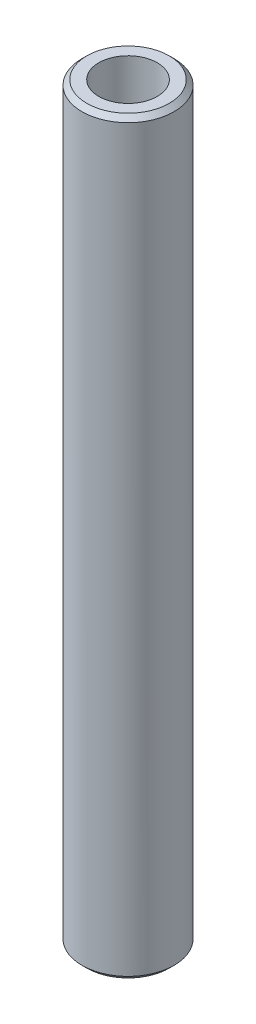
ISO-10303-21;
HEADER;
FILE_DESCRIPTION(('STEP AP214'),'2;1');
FILE_NAME('part.step','',(''),(''),'','','');
FILE_SCHEMA(('AUTOMOTIVE_DESIGN { 1 0 10303 214 1 1 1 1 }'));
ENDSEC;
DATA;
#1=APPLICATION_CONTEXT('core data for automotive mechanical design processes');
#2=APPLICATION_PROTOCOL_DEFINITION('international standard','automotive_design',2000,#1);
#3=PRODUCT_CONTEXT('',#1,'mechanical');
#4=PRODUCT('Part','Part','',(#3));
#5=PRODUCT_RELATED_PRODUCT_CATEGORY('part','',(#4));
#6=PRODUCT_DEFINITION_FORMATION('','',#4);
#7=PRODUCT_DEFINITION_CONTEXT('part definition',#1,'design');
#8=PRODUCT_DEFINITION('design','',#6,#7);
#9=PRODUCT_DEFINITION_SHAPE('','',#8);
#10=(LENGTH_UNIT() NAMED_UNIT(*) SI_UNIT(.MILLI.,.METRE.));
#11=(NAMED_UNIT(*) PLANE_ANGLE_UNIT() SI_UNIT($,.RADIAN.));
#12=(NAMED_UNIT(*) SI_UNIT($,.STERADIAN.) SOLID_ANGLE_UNIT());
#13=UNCERTAINTY_MEASURE_WITH_UNIT(LENGTH_MEASURE(1.E-05),#10,'distance_accuracy_value','');
#14=(GEOMETRIC_REPRESENTATION_CONTEXT(3) GLOBAL_UNCERTAINTY_ASSIGNED_CONTEXT((#13)) GLOBAL_UNIT_ASSIGNED_CONTEXT((#10,
#11,#12)) REPRESENTATION_CONTEXT('',''));
#15=CARTESIAN_POINT('',(0.,0.,0.));
#16=DIRECTION('',(0.,0.,1.));
#17=DIRECTION('',(1.,0.,0.));
#18=AXIS2_PLACEMENT_3D('',#15,#16,#17);
#19=CARTESIAN_POINT('',(0.,406.783600366524,0.));
#20=DIRECTION('',(0.,-1.,0.));
#21=DIRECTION('',(0.,0.,-1.));
#22=AXIS2_PLACEMENT_3D('',#19,#20,#21);
#23=CYLINDRICAL_SURFACE('',#22,25.);
#24=CARTESIAN_POINT('',(0.,404.167397021278,0.));
#25=DIRECTION('',(0.,1.,0.));
#26=DIRECTION('',(0.,0.,1.));
#27=AXIS2_PLACEMENT_3D('',#24,#25,#26);
#28=CIRCLE('',#27,25.);
#29=CARTESIAN_POINT('',(0.,404.167397021278,-25.));
#30=VERTEX_POINT('',#29);
#31=EDGE_CURVE('E50',#30,#30,#28,.F.);
#32=CARTESIAN_POINT('',(0.,2.6162033452472,0.));
#33=DIRECTION('',(0.,1.,0.));
#34=DIRECTION('',(0.,0.,1.));
#35=AXIS2_PLACEMENT_3D('',#32,#33,#34);
#36=CIRCLE('',#35,25.);
#37=CARTESIAN_POINT('',(0.,2.6162033452472,-25.));
#38=VERTEX_POINT('',#37);
#39=EDGE_CURVE('E51',#38,#38,#36,.T.);
#40=CARTESIAN_POINT('',(0.,404.167397021278,-25.));
#41=CARTESIAN_POINT('',(0.,399.984572087152,-25.));
#42=CARTESIAN_POINT('',(0.,395.801747153027,-25.));
#43=CARTESIAN_POINT('',(0.,387.436097284777,-25.));
#44=CARTESIAN_POINT('',(0.,383.253272350651,-25.));
#45=CARTESIAN_POINT('',(0.,374.887622482401,-25.));
#46=CARTESIAN_POINT('',(0.,370.704797548275,-25.));
#47=CARTESIAN_POINT('',(0.,362.339147680025,-25.));
#48=CARTESIAN_POINT('',(0.,358.156322745899,-25.));
#49=CARTESIAN_POINT('',(0.,349.790672877649,-25.));
#50=CARTESIAN_POINT('',(0.,345.607847943523,-25.));
#51=CARTESIAN_POINT('',(0.,337.242198075273,-25.));
#52=CARTESIAN_POINT('',(0.,333.059373141147,-25.));
#53=CARTESIAN_POINT('',(0.,324.693723272897,-25.));
#54=CARTESIAN_POINT('',(0.,320.510898338771,-25.));
#55=CARTESIAN_POINT('',(0.,312.145248470521,-25.));
#56=CARTESIAN_POINT('',(0.,307.962423536395,-25.));
#57=CARTESIAN_POINT('',(0.,299.596773668145,-25.));
#58=CARTESIAN_POINT('',(0.,295.413948734019,-25.));
#59=CARTESIAN_POINT('',(0.,287.048298865769,-25.));
#60=CARTESIAN_POINT('',(0.,282.865473931644,-25.));
#61=CARTESIAN_POINT('',(0.,274.499824063393,-25.));
#62=CARTESIAN_POINT('',(0.,270.316999129268,-25.));
#63=CARTESIAN_POINT('',(0.,261.951349261017,-25.));
#64=CARTESIAN_POINT('',(0.,257.768524326892,-25.));
#65=CARTESIAN_POINT('',(0.,249.402874458641,-25.));
#66=CARTESIAN_POINT('',(0.,245.220049524516,-25.));
#67=CARTESIAN_POINT('',(0.,236.854399656265,-25.));
#68=CARTESIAN_POINT('',(0.,232.67157472214,-25.));
#69=CARTESIAN_POINT('',(0.,224.305924853889,-25.));
#70=CARTESIAN_POINT('',(0.,220.123099919764,-25.));
#71=CARTESIAN_POINT('',(0.,211.757450051513,-25.));
#72=CARTESIAN_POINT('',(0.,207.574625117388,-25.));
#73=CARTESIAN_POINT('',(0.,199.208975249137,-25.));
#74=CARTESIAN_POINT('',(0.,195.026150315012,-25.));
#75=CARTESIAN_POINT('',(0.,186.660500446761,-25.));
#76=CARTESIAN_POINT('',(0.,182.477675512636,-25.));
#77=CARTESIAN_POINT('',(0.,174.112025644385,-25.));
#78=CARTESIAN_POINT('',(0.,169.92920071026,-25.));
#79=CARTESIAN_POINT('',(0.,161.563550842009,-25.));
#80=CARTESIAN_POINT('',(0.,157.380725907884,-25.));
#81=CARTESIAN_POINT('',(0.,149.015076039633,-25.));
#82=CARTESIAN_POINT('',(0.,144.832251105508,-25.));
#83=CARTESIAN_POINT('',(0.,136.466601237257,-25.));
#84=CARTESIAN_POINT('',(0.,132.283776303132,-25.));
#85=CARTESIAN_POINT('',(0.,123.918126434881,-25.));
#86=CARTESIAN_POINT('',(0.,119.735301500756,-25.));
#87=CARTESIAN_POINT('',(0.,111.369651632505,-25.));
#88=CARTESIAN_POINT('',(0.,107.18682669838,-25.));
#89=CARTESIAN_POINT('',(0.,98.8211768301295,-25.));
#90=CARTESIAN_POINT('',(0.,94.6383518960042,-25.));
#91=CARTESIAN_POINT('',(0.,86.2727020277536,-25.));
#92=CARTESIAN_POINT('',(0.,82.0898770936283,-25.));
#93=CARTESIAN_POINT('',(0.,73.7242272253776,-25.));
#94=CARTESIAN_POINT('',(0.,69.5414022912523,-25.));
#95=CARTESIAN_POINT('',(0.,61.1757524230017,-25.));
#96=CARTESIAN_POINT('',(0.,56.9929274888764,-25.));
#97=CARTESIAN_POINT('',(0.,48.6272776206257,-25.));
#98=CARTESIAN_POINT('',(0.,44.4444526865004,-25.));
#99=CARTESIAN_POINT('',(0.,36.0788028182497,-25.));
#100=CARTESIAN_POINT('',(0.,31.8959778841244,-25.));
#101=CARTESIAN_POINT('',(0.,23.5303280158738,-25.));
#102=CARTESIAN_POINT('',(0.,19.3475030817485,-25.));
#103=CARTESIAN_POINT('',(0.,10.9818532134979,-25.));
#104=CARTESIAN_POINT('',(0.,6.79902827937253,-25.));
#105=CARTESIAN_POINT('',(0.,2.6162033452472,-25.));
#106=B_SPLINE_CURVE_WITH_KNOTS('',3,(#40,#41,#42,#43,#44,#45,#46,#47,#48,#49,#50,#51,#52,#53,
#54,#55,#56,#57,#58,#59,#60,#61,#62,#63,#64,#65,#66,#67,#68,#69,#70,#71,#72,#73,#74,#75,#76,#77,
#78,#79,#80,#81,#82,#83,#84,#85,#86,#87,#88,#89,#90,#91,#92,#93,#94,#95,#96,#97,#98,#99,#100,
#101,#102,#103,#104,#105),.UNSPECIFIED.,.F.,.F.,(4,2,2,2,2,2,2,2,2,2,2,2,2,2,2,2,2,2,2,2,2,2,2,
2,2,2,2,2,2,2,2,2,4),(0.,12.5484748023759,25.0969496047519,37.6454244071278,50.1938992095038,
62.7423740118797,75.2908488142557,87.8393236166317,100.387798419008,112.936273221384,
125.484748023759,138.033222826135,150.581697628511,163.130172430887,175.678647233263,
188.227122035639,200.775596838015,213.324071640391,225.872546442767,238.421021245143,
250.969496047519,263.517970849895,276.066445652271,288.614920454647,301.163395257023,
313.711870059399,326.260344861775,338.808819664151,351.357294466527,363.905769268903,
376.454244071279,389.002718873655,401.551193676031),.UNSPECIFIED.);
#107=EDGE_CURVE('BSEAM39',#30,#38,#106,.T.);
#108=ORIENTED_EDGE('',*,*,#31,.T.);
#109=ORIENTED_EDGE('',*,*,#39,.T.);
#110=ORIENTED_EDGE('',*,*,#107,.T.);
#111=ORIENTED_EDGE('',*,*,#107,.F.);
#112=EDGE_LOOP('',(#108,#110,#109,#111));
#113=FACE_BOUND('',#112,.T.);
#114=ADVANCED_FACE('F39',(#113),#23,.T.);
#115=CARTESIAN_POINT('',(0.,406.783600366524,0.));
#116=DIRECTION('',(0.,1.,0.));
#117=DIRECTION('',(0.,0.,1.));
#118=AXIS2_PLACEMENT_3D('',#115,#116,#117);
#119=PLANE('',#118);
#120=CARTESIAN_POINT('',(0.,406.783600366524,0.));
#121=DIRECTION('',(0.,1.,0.));
#122=DIRECTION('',(0.,0.,1.));
#123=AXIS2_PLACEMENT_3D('',#120,#121,#122);
#124=CIRCLE('',#123,22.3837966547534);
#125=CARTESIAN_POINT('',(0.,406.783600366524,22.3837966547534));
#126=VERTEX_POINT('',#125);
#127=EDGE_CURVE('E54',#126,#126,#124,.T.);
#128=ORIENTED_EDGE('',*,*,#127,.T.);
#129=EDGE_LOOP('',(#128));
#130=FACE_BOUND('',#129,.T.);
#131=CARTESIAN_POINT('',(0.,406.783600366524,0.));
#132=DIRECTION('',(0.,1.,0.));
#133=DIRECTION('',(0.,0.,1.));
#134=AXIS2_PLACEMENT_3D('',#131,#132,#133);
#135=CIRCLE('',#134,15.8855936893013);
#136=CARTESIAN_POINT('',(0.,406.783600366524,-15.8855936893013));
#137=VERTEX_POINT('',#136);
#138=EDGE_CURVE('E58',#137,#137,#135,.T.);
#139=ORIENTED_EDGE('',*,*,#138,.F.);
#140=EDGE_LOOP('',(#139));
#141=FACE_BOUND('',#140,.T.);
#142=ADVANCED_FACE('F69',(#130,#141),#119,.T.);
#143=CARTESIAN_POINT('',(0.,0.,0.));
#144=DIRECTION('',(0.,1.,0.));
#145=DIRECTION('',(0.,0.,1.));
#146=AXIS2_PLACEMENT_3D('',#143,#144,#145);
#147=PLANE('',#146);
#148=CARTESIAN_POINT('',(0.,0.,0.));
#149=DIRECTION('',(0.,1.,0.));
#150=DIRECTION('',(0.,0.,1.));
#151=AXIS2_PLACEMENT_3D('',#148,#149,#150);
#152=CIRCLE('',#151,22.3837966547528);
#153=CARTESIAN_POINT('',(0.,0.,22.3837966547528));
#154=VERTEX_POINT('',#153);
#155=EDGE_CURVE('E10',#154,#154,#152,.F.);
#156=ORIENTED_EDGE('',*,*,#155,.T.);
#157=EDGE_LOOP('',(#156));
#158=FACE_BOUND('',#157,.T.);
#159=CARTESIAN_POINT('',(0.,0.,0.));
#160=DIRECTION('',(0.,1.,0.));
#161=DIRECTION('',(0.,0.,1.));
#162=AXIS2_PLACEMENT_3D('',#159,#160,#161);
#163=CIRCLE('',#162,15.8855936893013);
#164=CARTESIAN_POINT('',(0.,0.,-15.8855936893013));
#165=VERTEX_POINT('',#164);
#166=EDGE_CURVE('E63',#165,#165,#163,.T.);
#167=ORIENTED_EDGE('',*,*,#166,.T.);
#168=EDGE_LOOP('',(#167));
#169=FACE_BOUND('',#168,.T.);
#170=ADVANCED_FACE('F75',(#158,#169),#147,.F.);
#171=CARTESIAN_POINT('',(0.,406.783600366524,0.));
#172=DIRECTION('',(0.,-1.,0.));
#173=DIRECTION('',(0.,0.,-1.));
#174=AXIS2_PLACEMENT_3D('',#171,#172,#173);
#175=CYLINDRICAL_SURFACE('',#174,15.8855936893013);
#176=CARTESIAN_POINT('',(0.,406.783600366524,-15.8855936893013));
#177=CARTESIAN_POINT('',(0.,402.54627119604,-15.8855936893013));
#178=CARTESIAN_POINT('',(0.,398.308942025555,-15.8855936893013));
#179=CARTESIAN_POINT('',(0.,389.834283684586,-15.8855936893013));
#180=CARTESIAN_POINT('',(0.,385.596954514101,-15.8855936893013));
#181=CARTESIAN_POINT('',(0.,377.122296173132,-15.8855936893013));
#182=CARTESIAN_POINT('',(0.,372.884967002647,-15.8855936893013));
#183=CARTESIAN_POINT('',(0.,364.410308661678,-15.8855936893013));
#184=CARTESIAN_POINT('',(0.,360.172979491193,-15.8855936893013));
#185=CARTESIAN_POINT('',(0.,351.698321150224,-15.8855936893013));
#186=CARTESIAN_POINT('',(0.,347.46099197974,-15.8855936893013));
#187=CARTESIAN_POINT('',(0.,338.98633363877,-15.8855936893013));
#188=CARTESIAN_POINT('',(0.,334.749004468286,-15.8855936893013));
#189=CARTESIAN_POINT('',(0.,326.274346127316,-15.8855936893013));
#190=CARTESIAN_POINT('',(0.,322.037016956832,-15.8855936893013));
#191=CARTESIAN_POINT('',(0.,313.562358615863,-15.8855936893013));
#192=CARTESIAN_POINT('',(0.,309.325029445378,-15.8855936893013));
#193=CARTESIAN_POINT('',(0.,300.850371104409,-15.8855936893013));
#194=CARTESIAN_POINT('',(0.,296.613041933924,-15.8855936893013));
#195=CARTESIAN_POINT('',(0.,288.138383592955,-15.8855936893013));
#196=CARTESIAN_POINT('',(0.,283.90105442247,-15.8855936893013));
#197=CARTESIAN_POINT('',(0.,275.426396081501,-15.8855936893013));
#198=CARTESIAN_POINT('',(0.,271.189066911016,-15.8855936893013));
#199=CARTESIAN_POINT('',(0.,262.714408570047,-15.8855936893013));
#200=CARTESIAN_POINT('',(0.,258.477079399562,-15.8855936893013));
#201=CARTESIAN_POINT('',(0.,250.002421058593,-15.8855936893013));
#202=CARTESIAN_POINT('',(0.,245.765091888108,-15.8855936893013));
#203=CARTESIAN_POINT('',(0.,237.290433547139,-15.8855936893013));
#204=CARTESIAN_POINT('',(0.,233.053104376655,-15.8855936893013));
#205=CARTESIAN_POINT('',(0.,224.578446035685,-15.8855936893013));
#206=CARTESIAN_POINT('',(0.,220.341116865201,-15.8855936893013));
#207=CARTESIAN_POINT('',(0.,211.866458524231,-15.8855936893013));
#208=CARTESIAN_POINT('',(0.,207.629129353747,-15.8855936893013));
#209=CARTESIAN_POINT('',(0.,199.154471012778,-15.8855936893013));
#210=CARTESIAN_POINT('',(0.,194.917141842293,-15.8855936893013));
#211=CARTESIAN_POINT('',(0.,186.442483501324,-15.8855936893013));
#212=CARTESIAN_POINT('',(0.,182.205154330839,-15.8855936893013));
#213=CARTESIAN_POINT('',(0.,173.73049598987,-15.8855936893013));
#214=CARTESIAN_POINT('',(0.,169.493166819385,-15.8855936893013));
#215=CARTESIAN_POINT('',(0.,161.018508478416,-15.8855936893013));
#216=CARTESIAN_POINT('',(0.,156.781179307931,-15.8855936893013));
#217=CARTESIAN_POINT('',(0.,148.306520966962,-15.8855936893013));
#218=CARTESIAN_POINT('',(0.,144.069191796477,-15.8855936893013));
#219=CARTESIAN_POINT('',(0.,135.594533455508,-15.8855936893013));
#220=CARTESIAN_POINT('',(0.,131.357204285023,-15.8855936893013));
#221=CARTESIAN_POINT('',(0.,122.882545944054,-15.8855936893013));
#222=CARTESIAN_POINT('',(0.,118.64521677357,-15.8855936893013));
#223=CARTESIAN_POINT('',(0.,110.1705584326,-15.8855936893013));
#224=CARTESIAN_POINT('',(0.,105.933229262116,-15.8855936893013));
#225=CARTESIAN_POINT('',(0.,97.4585709211464,-15.8855936893013));
#226=CARTESIAN_POINT('',(0.,93.2212417506618,-15.8855936893013));
#227=CARTESIAN_POINT('',(0.,84.7465834096925,-15.8855936893013));
#228=CARTESIAN_POINT('',(0.,80.5092542392079,-15.8855936893013));
#229=CARTESIAN_POINT('',(0.,72.0345958982386,-15.8855936893013));
#230=CARTESIAN_POINT('',(0.,67.797266727754,-15.8855936893013));
#231=CARTESIAN_POINT('',(0.,59.3226083867848,-15.8855936893013));
#232=CARTESIAN_POINT('',(0.,55.0852792163001,-15.8855936893013));
#233=CARTESIAN_POINT('',(0.,46.6106208753309,-15.8855936893013));
#234=CARTESIAN_POINT('',(0.,42.3732917048463,-15.8855936893013));
#235=CARTESIAN_POINT('',(0.,33.898633363877,-15.8855936893013));
#236=CARTESIAN_POINT('',(0.,29.6613041933924,-15.8855936893013));
#237=CARTESIAN_POINT('',(0.,21.1866458524231,-15.8855936893013));
#238=CARTESIAN_POINT('',(0.,16.9493166819385,-15.8855936893013));
#239=CARTESIAN_POINT('',(0.,8.47465834096922,-15.8855936893013));
#240=CARTESIAN_POINT('',(0.,4.23732917048457,-15.8855936893013));
#241=CARTESIAN_POINT('',(0.,0.,-15.8855936893013));
#242=B_SPLINE_CURVE_WITH_KNOTS('',3,(#176,#177,#178,#179,#180,#181,#182,#183,#184,#185,#186,
#187,#188,#189,#190,#191,#192,#193,#194,#195,#196,#197,#198,#199,#200,#201,#202,#203,#204,#205,
#206,#207,#208,#209,#210,#211,#212,#213,#214,#215,#216,#217,#218,#219,#220,#221,#222,#223,#224,
#225,#226,#227,#228,#229,#230,#231,#232,#233,#234,#235,#236,#237,#238,#239,#240,#241),
.UNSPECIFIED.,.F.,.F.,(4,2,2,2,2,2,2,2,2,2,2,2,2,2,2,2,2,2,2,2,2,2,2,2,2,2,2,2,2,2,2,2,4),(0.,
12.7119875114539,25.4239750229078,38.1359625343616,50.8479500458155,63.5599375572694,
76.2719250687233,88.9839125801772,101.695900091631,114.407887603085,127.119875114539,
139.831862625993,152.543850137447,165.2558376489,177.967825160354,190.679812671808,
203.391800183262,216.103787694716,228.81577520617,241.527762717624,254.239750229078,
266.951737740532,279.663725251986,292.375712763439,305.087700274893,317.799687786347,
330.511675297801,343.223662809255,355.935650320709,368.647637832163,381.359625343617,
394.07161285507,406.783600366524),.UNSPECIFIED.);
#243=EDGE_CURVE('BSEAM70',#137,#165,#242,.T.);
#244=ORIENTED_EDGE('',*,*,#138,.T.);
#245=ORIENTED_EDGE('',*,*,#166,.F.);
#246=ORIENTED_EDGE('',*,*,#243,.T.);
#247=ORIENTED_EDGE('',*,*,#243,.F.);
#248=EDGE_LOOP('',(#244,#246,#245,#247));
#249=FACE_BOUND('',#248,.T.);
#250=ADVANCED_FACE('F70',(#249),#175,.F.);
#251=CARTESIAN_POINT('',(0.,406.783600366524,0.));
#252=DIRECTION('',(0.,-1.,0.));
#253=DIRECTION('',(0.,0.,-1.));
#254=AXIS2_PLACEMENT_3D('',#251,#252,#253);
#255=CONICAL_SURFACE('',#254,22.3837966547534,0.785398163397456);
#256=ORIENTED_EDGE('',*,*,#31,.F.);
#257=EDGE_LOOP('',(#256));
#258=FACE_BOUND('',#257,.T.);
#259=ORIENTED_EDGE('',*,*,#127,.F.);
#260=EDGE_LOOP('',(#259));
#261=FACE_BOUND('',#260,.T.);
#262=ADVANCED_FACE('F81',(#258,#261),#255,.T.);
#263=CARTESIAN_POINT('',(0.,2.6162033452472,0.));
#264=DIRECTION('',(0.,1.,0.));
#265=DIRECTION('',(0.,0.,1.));
#266=AXIS2_PLACEMENT_3D('',#263,#264,#265);
#267=CONICAL_SURFACE('',#266,25.,0.785398163397445);
#268=ORIENTED_EDGE('',*,*,#155,.F.);
#269=EDGE_LOOP('',(#268));
#270=FACE_BOUND('',#269,.T.);
#271=ORIENTED_EDGE('',*,*,#39,.F.);
#272=EDGE_LOOP('',(#271));
#273=FACE_BOUND('',#272,.T.);
#274=ADVANCED_FACE('F45',(#270,#273),#267,.T.);
#275=CLOSED_SHELL('',(#114,#142,#170,#250,#262,#274));
#276=MANIFOLD_SOLID_BREP('B2',#275);
#277=ADVANCED_BREP_SHAPE_REPRESENTATION('',(#18,#276),#14);
#278=SHAPE_DEFINITION_REPRESENTATION(#9,#277);
ENDSEC;
END-ISO-10303-21;
